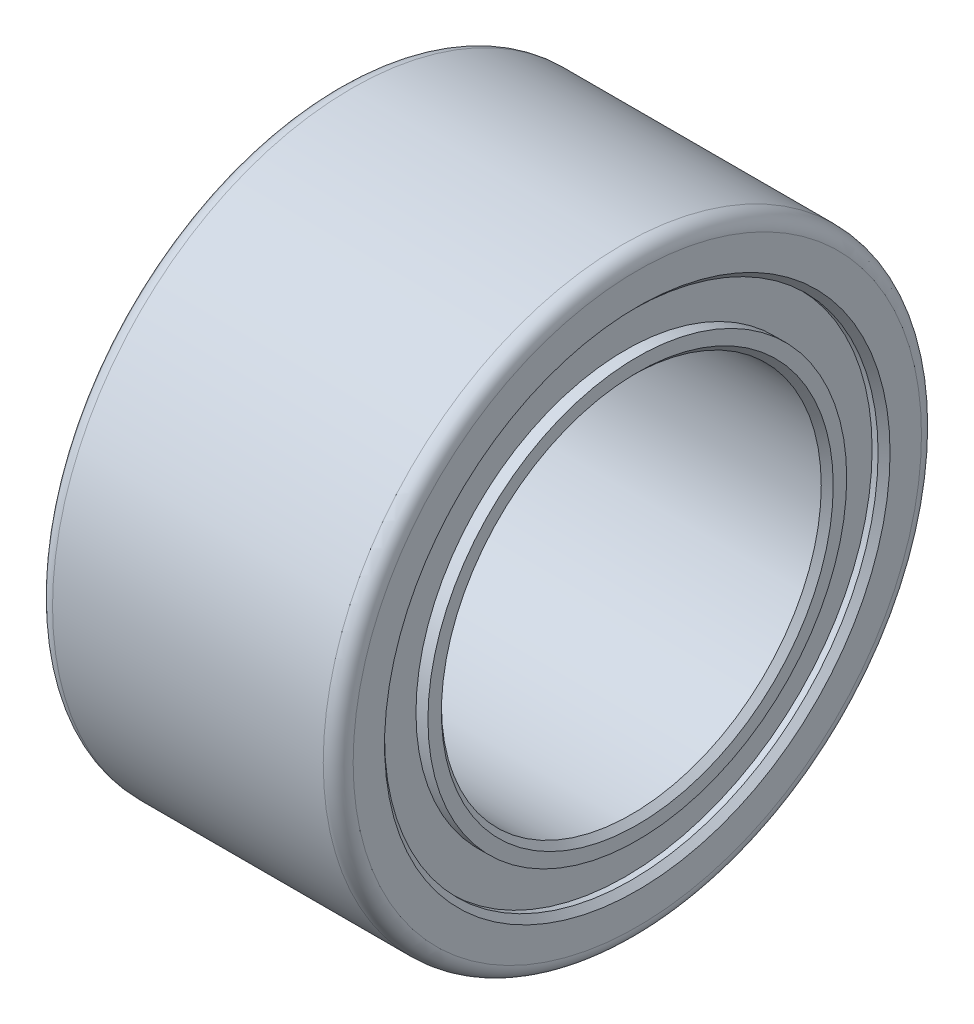
ISO-10303-21;
HEADER;
FILE_DESCRIPTION(('STEP AP214'),'2;1');
FILE_NAME('part.step','',(''),(''),'','','');
FILE_SCHEMA(('AUTOMOTIVE_DESIGN { 1 0 10303 214 1 1 1 1 }'));
ENDSEC;
DATA;
#1=APPLICATION_CONTEXT('core data for automotive mechanical design processes');
#2=APPLICATION_PROTOCOL_DEFINITION('international standard','automotive_design',2000,#1);
#3=PRODUCT_CONTEXT('',#1,'mechanical');
#4=PRODUCT('Part','Part','',(#3));
#5=PRODUCT_RELATED_PRODUCT_CATEGORY('part','',(#4));
#6=PRODUCT_DEFINITION_FORMATION('','',#4);
#7=PRODUCT_DEFINITION_CONTEXT('part definition',#1,'design');
#8=PRODUCT_DEFINITION('design','',#6,#7);
#9=PRODUCT_DEFINITION_SHAPE('','',#8);
#10=(LENGTH_UNIT() NAMED_UNIT(*) SI_UNIT(.MILLI.,.METRE.));
#11=(NAMED_UNIT(*) PLANE_ANGLE_UNIT() SI_UNIT($,.RADIAN.));
#12=(NAMED_UNIT(*) SI_UNIT($,.STERADIAN.) SOLID_ANGLE_UNIT());
#13=UNCERTAINTY_MEASURE_WITH_UNIT(LENGTH_MEASURE(1.E-05),#10,'distance_accuracy_value','');
#14=(GEOMETRIC_REPRESENTATION_CONTEXT(3) GLOBAL_UNCERTAINTY_ASSIGNED_CONTEXT((#13)) GLOBAL_UNIT_ASSIGNED_CONTEXT((#10,
#11,#12)) REPRESENTATION_CONTEXT('',''));
#15=CARTESIAN_POINT('',(0.,0.,0.));
#16=DIRECTION('',(0.,0.,1.));
#17=DIRECTION('',(1.,0.,0.));
#18=AXIS2_PLACEMENT_3D('',#15,#16,#17);
#19=CARTESIAN_POINT('',(-2.4892,0.,0.));
#20=DIRECTION('',(1.,0.,0.));
#21=DIRECTION('',(0.,0.,-1.));
#22=AXIS2_PLACEMENT_3D('',#19,#20,#21);
#23=PLANE('',#22);
#24=CARTESIAN_POINT('',(-2.4892,0.,0.));
#25=DIRECTION('',(1.,0.,0.));
#26=DIRECTION('',(0.,0.,-1.));
#27=AXIS2_PLACEMENT_3D('',#24,#25,#26);
#28=CIRCLE('',#27,4.9);
#29=CARTESIAN_POINT('',(-2.4892,0.,-4.9));
#30=VERTEX_POINT('',#29);
#31=EDGE_CURVE('E53',#30,#30,#28,.F.);
#32=ORIENTED_EDGE('',*,*,#31,.T.);
#33=EDGE_LOOP('',(#32));
#34=FACE_BOUND('',#33,.T.);
#35=CARTESIAN_POINT('',(-2.4892,0.,0.));
#36=DIRECTION('',(1.,0.,0.));
#37=DIRECTION('',(0.,0.,-1.));
#38=AXIS2_PLACEMENT_3D('',#35,#36,#37);
#39=CIRCLE('',#38,4.125);
#40=CARTESIAN_POINT('',(-2.4892,0.,-4.125));
#41=VERTEX_POINT('',#40);
#42=EDGE_CURVE('E84',#41,#41,#39,.T.);
#43=ORIENTED_EDGE('',*,*,#42,.T.);
#44=EDGE_LOOP('',(#43));
#45=FACE_BOUND('',#44,.T.);
#46=ADVANCED_FACE('F33',(#34,#45),#23,.F.);
#47=CARTESIAN_POINT('',(2.4892,0.,0.));
#48=DIRECTION('',(1.,0.,0.));
#49=DIRECTION('',(0.,0.,-1.));
#50=AXIS2_PLACEMENT_3D('',#47,#48,#49);
#51=PLANE('',#50);
#52=CARTESIAN_POINT('',(2.4892,0.,0.));
#53=DIRECTION('',(1.,0.,0.));
#54=DIRECTION('',(0.,0.,-1.));
#55=AXIS2_PLACEMENT_3D('',#52,#53,#54);
#56=CIRCLE('',#55,3.275);
#57=CARTESIAN_POINT('',(2.4892,0.,-3.275));
#58=VERTEX_POINT('',#57);
#59=EDGE_CURVE('E59',#58,#58,#56,.F.);
#60=ORIENTED_EDGE('',*,*,#59,.T.);
#61=EDGE_LOOP('',(#60));
#62=FACE_BOUND('',#61,.T.);
#63=CARTESIAN_POINT('',(2.4892,0.,0.));
#64=DIRECTION('',(1.,0.,0.));
#65=DIRECTION('',(0.,0.,-1.));
#66=AXIS2_PLACEMENT_3D('',#63,#64,#65);
#67=CIRCLE('',#66,3.5);
#68=CARTESIAN_POINT('',(2.4892,0.,-3.5));
#69=VERTEX_POINT('',#68);
#70=EDGE_CURVE('E78',#69,#69,#67,.T.);
#71=ORIENTED_EDGE('',*,*,#70,.T.);
#72=EDGE_LOOP('',(#71));
#73=FACE_BOUND('',#72,.T.);
#74=ADVANCED_FACE('F122',(#62,#73),#51,.T.);
#75=CARTESIAN_POINT('',(2.4892,0.,0.));
#76=DIRECTION('',(-1.,0.,0.));
#77=DIRECTION('',(0.,0.,1.));
#78=AXIS2_PLACEMENT_3D('',#75,#76,#77);
#79=CYLINDRICAL_SURFACE('',#78,5.);
#80=CARTESIAN_POINT('',(-2.28564660940672,0.,0.));
#81=DIRECTION('',(-1.,0.,0.));
#82=DIRECTION('',(0.,0.,1.));
#83=AXIS2_PLACEMENT_3D('',#80,#81,#82);
#84=CIRCLE('',#83,5.);
#85=CARTESIAN_POINT('',(-2.28564660940672,0.,5.));
#86=VERTEX_POINT('',#85);
#87=EDGE_CURVE('E44',#86,#86,#84,.F.);
#88=ORIENTED_EDGE('',*,*,#87,.T.);
#89=EDGE_LOOP('',(#88));
#90=FACE_BOUND('',#89,.T.);
#91=CARTESIAN_POINT('',(2.2392,0.,0.));
#92=DIRECTION('',(1.,0.,0.));
#93=DIRECTION('',(0.,0.,-1.));
#94=AXIS2_PLACEMENT_3D('',#91,#92,#93);
#95=CIRCLE('',#94,5.);
#96=CARTESIAN_POINT('',(2.2392,0.,-5.));
#97=VERTEX_POINT('',#96);
#98=EDGE_CURVE('E48',#97,#97,#95,.F.);
#99=ORIENTED_EDGE('',*,*,#98,.T.);
#100=EDGE_LOOP('',(#99));
#101=FACE_BOUND('',#100,.T.);
#102=ADVANCED_FACE('F120',(#90,#101),#79,.T.);
#103=CARTESIAN_POINT('',(2.4892,0.,0.));
#104=DIRECTION('',(1.,0.,0.));
#105=DIRECTION('',(0.,0.,-1.));
#106=AXIS2_PLACEMENT_3D('',#103,#104,#105);
#107=CIRCLE('',#106,4.75);
#108=CARTESIAN_POINT('',(2.4892,0.,-4.75));
#109=VERTEX_POINT('',#108);
#110=EDGE_CURVE('E10',#109,#109,#107,.T.);
#111=ORIENTED_EDGE('',*,*,#110,.T.);
#112=EDGE_LOOP('',(#111));
#113=FACE_BOUND('',#112,.T.);
#114=CARTESIAN_POINT('',(2.4892,0.,0.));
#115=DIRECTION('',(1.,0.,0.));
#116=DIRECTION('',(0.,0.,-1.));
#117=AXIS2_PLACEMENT_3D('',#114,#115,#116);
#118=CIRCLE('',#117,4.225);
#119=CARTESIAN_POINT('',(2.4892,0.,-4.225));
#120=VERTEX_POINT('',#119);
#121=EDGE_CURVE('E68',#120,#120,#118,.F.);
#122=ORIENTED_EDGE('',*,*,#121,.T.);
#123=EDGE_LOOP('',(#122));
#124=FACE_BOUND('',#123,.T.);
#125=ADVANCED_FACE('F109',(#113,#124),#51,.T.);
#126=CARTESIAN_POINT('',(-2.4892,0.,0.));
#127=DIRECTION('',(1.,0.,0.));
#128=DIRECTION('',(0.,0.,-1.));
#129=AXIS2_PLACEMENT_3D('',#126,#127,#128);
#130=CIRCLE('',#129,3.275);
#131=CARTESIAN_POINT('',(-2.4892,0.,-3.275));
#132=VERTEX_POINT('',#131);
#133=EDGE_CURVE('E56',#132,#132,#130,.T.);
#134=ORIENTED_EDGE('',*,*,#133,.T.);
#135=EDGE_LOOP('',(#134));
#136=FACE_BOUND('',#135,.T.);
#137=CARTESIAN_POINT('',(-2.4892,0.,0.));
#138=DIRECTION('',(1.,0.,0.));
#139=DIRECTION('',(0.,0.,-1.));
#140=AXIS2_PLACEMENT_3D('',#137,#138,#139);
#141=CIRCLE('',#140,3.5);
#142=CARTESIAN_POINT('',(-2.4892,0.,-3.5));
#143=VERTEX_POINT('',#142);
#144=EDGE_CURVE('E90',#143,#143,#141,.T.);
#145=ORIENTED_EDGE('',*,*,#144,.F.);
#146=EDGE_LOOP('',(#145));
#147=FACE_BOUND('',#146,.T.);
#148=ADVANCED_FACE('F106',(#136,#147),#23,.F.);
#149=CARTESIAN_POINT('',(-2.4892,0.,0.));
#150=DIRECTION('',(1.,0.,0.));
#151=DIRECTION('',(0.,0.,-1.));
#152=AXIS2_PLACEMENT_3D('',#149,#150,#151);
#153=CYLINDRICAL_SURFACE('',#152,3.175);
#154=CARTESIAN_POINT('',(2.3892,0.,0.));
#155=DIRECTION('',(1.,0.,0.));
#156=DIRECTION('',(0.,0.,-1.));
#157=AXIS2_PLACEMENT_3D('',#154,#155,#156);
#158=CIRCLE('',#157,3.175);
#159=CARTESIAN_POINT('',(2.3892,0.,-3.175));
#160=VERTEX_POINT('',#159);
#161=EDGE_CURVE('E62',#160,#160,#158,.T.);
#162=ORIENTED_EDGE('',*,*,#161,.T.);
#163=EDGE_LOOP('',(#162));
#164=FACE_BOUND('',#163,.T.);
#165=CARTESIAN_POINT('',(-2.3892,0.,0.));
#166=DIRECTION('',(1.,0.,0.));
#167=DIRECTION('',(0.,0.,-1.));
#168=AXIS2_PLACEMENT_3D('',#165,#166,#167);
#169=CIRCLE('',#168,3.175);
#170=CARTESIAN_POINT('',(-2.3892,0.,-3.175));
#171=VERTEX_POINT('',#170);
#172=EDGE_CURVE('E65',#171,#171,#169,.F.);
#173=ORIENTED_EDGE('',*,*,#172,.T.);
#174=EDGE_LOOP('',(#173));
#175=FACE_BOUND('',#174,.T.);
#176=ADVANCED_FACE('F108',(#164,#175),#153,.F.);
#177=CARTESIAN_POINT('',(2.2892,0.,0.));
#178=DIRECTION('',(1.,0.,0.));
#179=DIRECTION('',(0.,0.,-1.));
#180=AXIS2_PLACEMENT_3D('',#177,#178,#179);
#181=CYLINDRICAL_SURFACE('',#180,4.125);
#182=CARTESIAN_POINT('',(2.3892,0.,0.));
#183=DIRECTION('',(1.,0.,0.));
#184=DIRECTION('',(0.,0.,-1.));
#185=AXIS2_PLACEMENT_3D('',#182,#183,#184);
#186=CIRCLE('',#185,4.125);
#187=CARTESIAN_POINT('',(2.3892,0.,-4.125));
#188=VERTEX_POINT('',#187);
#189=EDGE_CURVE('E71',#188,#188,#186,.T.);
#190=ORIENTED_EDGE('',*,*,#189,.T.);
#191=EDGE_LOOP('',(#190));
#192=FACE_BOUND('',#191,.T.);
#193=CARTESIAN_POINT('',(2.2892,0.,0.));
#194=DIRECTION('',(1.,0.,0.));
#195=DIRECTION('',(0.,0.,-1.));
#196=AXIS2_PLACEMENT_3D('',#193,#194,#195);
#197=CIRCLE('',#196,4.125);
#198=CARTESIAN_POINT('',(2.2892,0.,-4.125));
#199=VERTEX_POINT('',#198);
#200=EDGE_CURVE('E74',#199,#199,#197,.T.);
#201=ORIENTED_EDGE('',*,*,#200,.F.);
#202=EDGE_LOOP('',(#201));
#203=FACE_BOUND('',#202,.T.);
#204=ADVANCED_FACE('F116',(#192,#203),#181,.F.);
#205=CARTESIAN_POINT('',(2.2892,0.,0.));
#206=DIRECTION('',(1.,0.,0.));
#207=DIRECTION('',(0.,0.,-1.));
#208=AXIS2_PLACEMENT_3D('',#205,#206,#207);
#209=PLANE('',#208);
#210=CARTESIAN_POINT('',(2.2892,0.,0.));
#211=DIRECTION('',(1.,0.,0.));
#212=DIRECTION('',(0.,0.,-1.));
#213=AXIS2_PLACEMENT_3D('',#210,#211,#212);
#214=CIRCLE('',#213,3.5);
#215=CARTESIAN_POINT('',(2.2892,0.,-3.5));
#216=VERTEX_POINT('',#215);
#217=EDGE_CURVE('E77',#216,#216,#214,.T.);
#218=ORIENTED_EDGE('',*,*,#217,.F.);
#219=EDGE_LOOP('',(#218));
#220=FACE_BOUND('',#219,.T.);
#221=ORIENTED_EDGE('',*,*,#200,.T.);
#222=EDGE_LOOP('',(#221));
#223=FACE_BOUND('',#222,.T.);
#224=ADVANCED_FACE('F146',(#220,#223),#209,.T.);
#225=CARTESIAN_POINT('',(2.2892,0.,0.));
#226=DIRECTION('',(1.,0.,0.));
#227=DIRECTION('',(0.,0.,-1.));
#228=AXIS2_PLACEMENT_3D('',#225,#226,#227);
#229=CYLINDRICAL_SURFACE('',#228,3.5);
#230=ORIENTED_EDGE('',*,*,#217,.T.);
#231=EDGE_LOOP('',(#230));
#232=FACE_BOUND('',#231,.T.);
#233=ORIENTED_EDGE('',*,*,#70,.F.);
#234=EDGE_LOOP('',(#233));
#235=FACE_BOUND('',#234,.T.);
#236=ADVANCED_FACE('F140',(#232,#235),#229,.T.);
#237=CARTESIAN_POINT('',(-2.2892,0.,0.));
#238=DIRECTION('',(-1.,0.,0.));
#239=DIRECTION('',(0.,0.,-1.));
#240=AXIS2_PLACEMENT_3D('',#237,#238,#239);
#241=PLANE('',#240);
#242=CARTESIAN_POINT('',(-2.2892,0.,0.));
#243=DIRECTION('',(1.,0.,0.));
#244=DIRECTION('',(0.,0.,-1.));
#245=AXIS2_PLACEMENT_3D('',#242,#243,#244);
#246=CIRCLE('',#245,4.125);
#247=CARTESIAN_POINT('',(-2.2892,0.,-4.125));
#248=VERTEX_POINT('',#247);
#249=EDGE_CURVE('E81',#248,#248,#246,.T.);
#250=ORIENTED_EDGE('',*,*,#249,.F.);
#251=EDGE_LOOP('',(#250));
#252=FACE_BOUND('',#251,.T.);
#253=CARTESIAN_POINT('',(-2.2892,0.,0.));
#254=DIRECTION('',(1.,0.,0.));
#255=DIRECTION('',(0.,0.,-1.));
#256=AXIS2_PLACEMENT_3D('',#253,#254,#255);
#257=CIRCLE('',#256,3.5);
#258=CARTESIAN_POINT('',(-2.2892,0.,-3.5));
#259=VERTEX_POINT('',#258);
#260=EDGE_CURVE('E87',#259,#259,#257,.T.);
#261=ORIENTED_EDGE('',*,*,#260,.T.);
#262=EDGE_LOOP('',(#261));
#263=FACE_BOUND('',#262,.T.);
#264=ADVANCED_FACE('F96',(#252,#263),#241,.T.);
#265=CARTESIAN_POINT('',(-2.2892,0.,0.));
#266=DIRECTION('',(-1.,0.,0.));
#267=DIRECTION('',(0.,0.,1.));
#268=AXIS2_PLACEMENT_3D('',#265,#266,#267);
#269=CYLINDRICAL_SURFACE('',#268,4.125);
#270=ORIENTED_EDGE('',*,*,#249,.T.);
#271=EDGE_LOOP('',(#270));
#272=FACE_BOUND('',#271,.T.);
#273=ORIENTED_EDGE('',*,*,#42,.F.);
#274=EDGE_LOOP('',(#273));
#275=FACE_BOUND('',#274,.T.);
#276=ADVANCED_FACE('F102',(#272,#275),#269,.F.);
#277=CARTESIAN_POINT('',(-2.2892,0.,0.));
#278=DIRECTION('',(-1.,0.,0.));
#279=DIRECTION('',(0.,0.,1.));
#280=AXIS2_PLACEMENT_3D('',#277,#278,#279);
#281=CYLINDRICAL_SURFACE('',#280,3.5);
#282=ORIENTED_EDGE('',*,*,#260,.F.);
#283=EDGE_LOOP('',(#282));
#284=FACE_BOUND('',#283,.T.);
#285=ORIENTED_EDGE('',*,*,#144,.T.);
#286=EDGE_LOOP('',(#285));
#287=FACE_BOUND('',#286,.T.);
#288=ADVANCED_FACE('F98',(#284,#287),#281,.T.);
#289=CARTESIAN_POINT('',(2.3892,0.,0.));
#290=DIRECTION('',(1.,0.,0.));
#291=DIRECTION('',(0.,0.,-1.));
#292=AXIS2_PLACEMENT_3D('',#289,#290,#291);
#293=CONICAL_SURFACE('',#292,4.125,0.785398163397461);
#294=ORIENTED_EDGE('',*,*,#121,.F.);
#295=EDGE_LOOP('',(#294));
#296=FACE_BOUND('',#295,.T.);
#297=ORIENTED_EDGE('',*,*,#189,.F.);
#298=EDGE_LOOP('',(#297));
#299=FACE_BOUND('',#298,.T.);
#300=ADVANCED_FACE('F101',(#296,#299),#293,.F.);
#301=CARTESIAN_POINT('',(2.3892,0.,0.));
#302=DIRECTION('',(1.,0.,0.));
#303=DIRECTION('',(0.,0.,-1.));
#304=AXIS2_PLACEMENT_3D('',#301,#302,#303);
#305=CONICAL_SURFACE('',#304,3.175,0.78539816339745);
#306=ORIENTED_EDGE('',*,*,#59,.F.);
#307=EDGE_LOOP('',(#306));
#308=FACE_BOUND('',#307,.T.);
#309=ORIENTED_EDGE('',*,*,#161,.F.);
#310=EDGE_LOOP('',(#309));
#311=FACE_BOUND('',#310,.T.);
#312=ADVANCED_FACE('F161',(#308,#311),#305,.F.);
#313=CARTESIAN_POINT('',(-2.4892,0.,0.));
#314=DIRECTION('',(-1.,0.,0.));
#315=DIRECTION('',(0.,0.,1.));
#316=AXIS2_PLACEMENT_3D('',#313,#314,#315);
#317=CONICAL_SURFACE('',#316,3.275,0.785398163397442);
#318=ORIENTED_EDGE('',*,*,#172,.F.);
#319=EDGE_LOOP('',(#318));
#320=FACE_BOUND('',#319,.T.);
#321=ORIENTED_EDGE('',*,*,#133,.F.);
#322=EDGE_LOOP('',(#321));
#323=FACE_BOUND('',#322,.T.);
#324=ADVANCED_FACE('F167',(#320,#323),#317,.F.);
#325=CARTESIAN_POINT('',(-2.3892,0.,0.));
#326=DIRECTION('',(1.,0.,0.));
#327=DIRECTION('',(0.,0.,-1.));
#328=AXIS2_PLACEMENT_3D('',#325,#326,#327);
#329=CONICAL_SURFACE('',#328,5.,0.785398163397457);
#330=CARTESIAN_POINT('',(-2.46242330470336,0.,0.));
#331=DIRECTION('',(1.,0.,0.));
#332=DIRECTION('',(0.,0.,-1.));
#333=AXIS2_PLACEMENT_3D('',#330,#331,#332);
#334=CIRCLE('',#333,4.92677669529664);
#335=CARTESIAN_POINT('',(-2.46242330470336,0.,-4.92677669529664));
#336=VERTEX_POINT('',#335);
#337=EDGE_CURVE('E40',#336,#336,#334,.F.);
#338=ORIENTED_EDGE('',*,*,#337,.T.);
#339=EDGE_LOOP('',(#338));
#340=FACE_BOUND('',#339,.T.);
#341=ORIENTED_EDGE('',*,*,#31,.F.);
#342=EDGE_LOOP('',(#341));
#343=FACE_BOUND('',#342,.T.);
#344=ADVANCED_FACE('F174',(#340,#343),#329,.T.);
#345=CARTESIAN_POINT('',(-2.28564660940672,0.,0.));
#346=DIRECTION('',(-1.,0.,0.));
#347=DIRECTION('',(0.,0.,1.));
#348=AXIS2_PLACEMENT_3D('',#345,#346,#347);
#349=TOROIDAL_SURFACE('',#348,4.75,0.25);
#350=ORIENTED_EDGE('',*,*,#337,.F.);
#351=EDGE_LOOP('',(#350));
#352=FACE_BOUND('',#351,.T.);
#353=ORIENTED_EDGE('',*,*,#87,.F.);
#354=EDGE_LOOP('',(#353));
#355=FACE_BOUND('',#354,.T.);
#356=ADVANCED_FACE('F177',(#352,#355),#349,.T.);
#357=CARTESIAN_POINT('',(2.2392,0.,0.));
#358=DIRECTION('',(1.,0.,0.));
#359=DIRECTION('',(0.,0.,-1.));
#360=AXIS2_PLACEMENT_3D('',#357,#358,#359);
#361=TOROIDAL_SURFACE('',#360,4.75,0.25);
#362=ORIENTED_EDGE('',*,*,#98,.F.);
#363=EDGE_LOOP('',(#362));
#364=FACE_BOUND('',#363,.T.);
#365=ORIENTED_EDGE('',*,*,#110,.F.);
#366=EDGE_LOOP('',(#365));
#367=FACE_BOUND('',#366,.T.);
#368=ADVANCED_FACE('F35',(#364,#367),#361,.T.);
#369=CLOSED_SHELL('',(#46,#74,#102,#125,#148,#176,#204,#224,#236,#264,#276,#288,#300,#312,#324,
#344,#356,#368));
#370=MANIFOLD_SOLID_BREP('B2',#369);
#371=ADVANCED_BREP_SHAPE_REPRESENTATION('',(#18,#370),#14);
#372=SHAPE_DEFINITION_REPRESENTATION(#9,#371);
ENDSEC;
END-ISO-10303-21;
